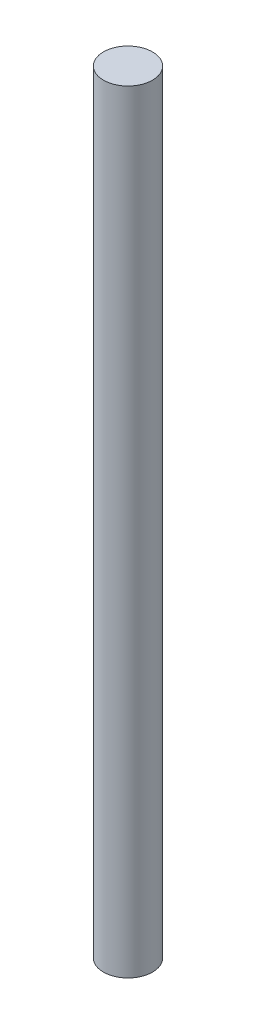
ISO-10303-21;
HEADER;
FILE_DESCRIPTION(('STEP AP214'),'2;1');
FILE_NAME('part.step','',(''),(''),'','','');
FILE_SCHEMA(('AUTOMOTIVE_DESIGN { 1 0 10303 214 1 1 1 1 }'));
ENDSEC;
DATA;
#1=APPLICATION_CONTEXT('core data for automotive mechanical design processes');
#2=APPLICATION_PROTOCOL_DEFINITION('international standard','automotive_design',2000,#1);
#3=PRODUCT_CONTEXT('',#1,'mechanical');
#4=PRODUCT('Part','Part','',(#3));
#5=PRODUCT_RELATED_PRODUCT_CATEGORY('part','',(#4));
#6=PRODUCT_DEFINITION_FORMATION('','',#4);
#7=PRODUCT_DEFINITION_CONTEXT('part definition',#1,'design');
#8=PRODUCT_DEFINITION('design','',#6,#7);
#9=PRODUCT_DEFINITION_SHAPE('','',#8);
#10=(LENGTH_UNIT() NAMED_UNIT(*) SI_UNIT(.MILLI.,.METRE.));
#11=(NAMED_UNIT(*) PLANE_ANGLE_UNIT() SI_UNIT($,.RADIAN.));
#12=(NAMED_UNIT(*) SI_UNIT($,.STERADIAN.) SOLID_ANGLE_UNIT());
#13=UNCERTAINTY_MEASURE_WITH_UNIT(LENGTH_MEASURE(1.E-05),#10,'distance_accuracy_value','');
#14=(GEOMETRIC_REPRESENTATION_CONTEXT(3) GLOBAL_UNCERTAINTY_ASSIGNED_CONTEXT((#13)) GLOBAL_UNIT_ASSIGNED_CONTEXT((#10,
#11,#12)) REPRESENTATION_CONTEXT('',''));
#15=CARTESIAN_POINT('',(0.,0.,0.));
#16=DIRECTION('',(0.,0.,1.));
#17=DIRECTION('',(1.,0.,0.));
#18=AXIS2_PLACEMENT_3D('',#15,#16,#17);
#19=CARTESIAN_POINT('',(0.,100.,0.));
#20=DIRECTION('',(0.,-1.,0.));
#21=DIRECTION('',(0.,0.,-1.));
#22=AXIS2_PLACEMENT_3D('',#19,#20,#21);
#23=CYLINDRICAL_SURFACE('',#22,3.175);
#24=CARTESIAN_POINT('',(0.,100.,0.));
#25=DIRECTION('',(0.,1.,0.));
#26=DIRECTION('',(0.,0.,1.));
#27=AXIS2_PLACEMENT_3D('',#24,#25,#26);
#28=CIRCLE('',#27,3.175);
#29=CARTESIAN_POINT('',(0.,100.,3.175));
#30=VERTEX_POINT('',#29);
#31=EDGE_CURVE('E10',#30,#30,#28,.T.);
#32=ORIENTED_EDGE('',*,*,#31,.F.);
#33=EDGE_LOOP('',(#32));
#34=FACE_BOUND('',#33,.T.);
#35=CARTESIAN_POINT('',(0.,0.,0.));
#36=DIRECTION('',(0.,1.,0.));
#37=DIRECTION('',(0.,0.,1.));
#38=AXIS2_PLACEMENT_3D('',#35,#36,#37);
#39=CIRCLE('',#38,3.175);
#40=CARTESIAN_POINT('',(0.,0.,3.175));
#41=VERTEX_POINT('',#40);
#42=EDGE_CURVE('E33',#41,#41,#39,.T.);
#43=ORIENTED_EDGE('',*,*,#42,.T.);
#44=EDGE_LOOP('',(#43));
#45=FACE_BOUND('',#44,.T.);
#46=ADVANCED_FACE('F30',(#34,#45),#23,.T.);
#47=CARTESIAN_POINT('',(0.,100.,0.));
#48=DIRECTION('',(0.,1.,0.));
#49=DIRECTION('',(0.,0.,1.));
#50=AXIS2_PLACEMENT_3D('',#47,#48,#49);
#51=PLANE('',#50);
#52=ORIENTED_EDGE('',*,*,#31,.T.);
#53=EDGE_LOOP('',(#52));
#54=FACE_BOUND('',#53,.T.);
#55=ADVANCED_FACE('F45',(#54),#51,.T.);
#56=CARTESIAN_POINT('',(0.,0.,0.));
#57=DIRECTION('',(0.,1.,0.));
#58=DIRECTION('',(0.,0.,1.));
#59=AXIS2_PLACEMENT_3D('',#56,#57,#58);
#60=PLANE('',#59);
#61=ORIENTED_EDGE('',*,*,#42,.F.);
#62=EDGE_LOOP('',(#61));
#63=FACE_BOUND('',#62,.T.);
#64=ADVANCED_FACE('F43',(#63),#60,.F.);
#65=CLOSED_SHELL('',(#46,#55,#64));
#66=MANIFOLD_SOLID_BREP('B2',#65);
#67=ADVANCED_BREP_SHAPE_REPRESENTATION('',(#18,#66),#14);
#68=SHAPE_DEFINITION_REPRESENTATION(#9,#67);
ENDSEC;
END-ISO-10303-21;
